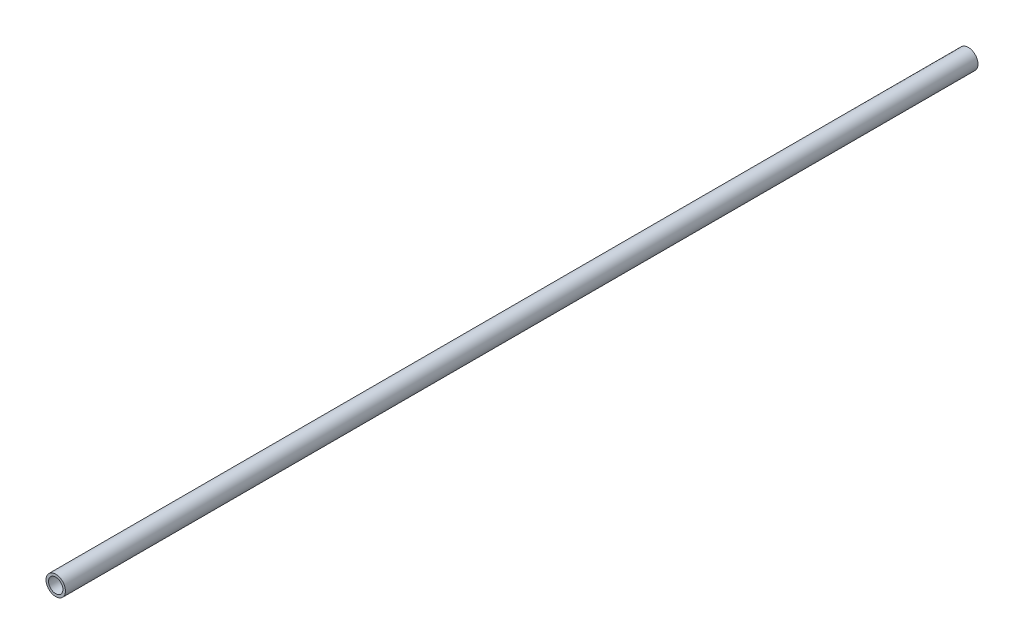
ISO-10303-21;
HEADER;
FILE_DESCRIPTION(('STEP AP214'),'2;1');
FILE_NAME('part.step','',(''),(''),'','','');
FILE_SCHEMA(('AUTOMOTIVE_DESIGN { 1 0 10303 214 1 1 1 1 }'));
ENDSEC;
DATA;
#1=APPLICATION_CONTEXT('core data for automotive mechanical design processes');
#2=APPLICATION_PROTOCOL_DEFINITION('international standard','automotive_design',2000,#1);
#3=PRODUCT_CONTEXT('',#1,'mechanical');
#4=PRODUCT('Part','Part','',(#3));
#5=PRODUCT_RELATED_PRODUCT_CATEGORY('part','',(#4));
#6=PRODUCT_DEFINITION_FORMATION('','',#4);
#7=PRODUCT_DEFINITION_CONTEXT('part definition',#1,'design');
#8=PRODUCT_DEFINITION('design','',#6,#7);
#9=PRODUCT_DEFINITION_SHAPE('','',#8);
#10=(LENGTH_UNIT() NAMED_UNIT(*) SI_UNIT(.MILLI.,.METRE.));
#11=(NAMED_UNIT(*) PLANE_ANGLE_UNIT() SI_UNIT($,.RADIAN.));
#12=(NAMED_UNIT(*) SI_UNIT($,.STERADIAN.) SOLID_ANGLE_UNIT());
#13=UNCERTAINTY_MEASURE_WITH_UNIT(LENGTH_MEASURE(1.E-05),#10,'distance_accuracy_value','');
#14=(GEOMETRIC_REPRESENTATION_CONTEXT(3) GLOBAL_UNCERTAINTY_ASSIGNED_CONTEXT((#13)) GLOBAL_UNIT_ASSIGNED_CONTEXT((#10,
#11,#12)) REPRESENTATION_CONTEXT('',''));
#15=CARTESIAN_POINT('',(0.,0.,0.));
#16=DIRECTION('',(0.,0.,1.));
#17=DIRECTION('',(1.,0.,0.));
#18=AXIS2_PLACEMENT_3D('',#15,#16,#17);
#19=CARTESIAN_POINT('',(0.,0.,500.));
#20=DIRECTION('',(0.,0.,1.));
#21=DIRECTION('',(1.,0.,0.));
#22=AXIS2_PLACEMENT_3D('',#19,#20,#21);
#23=PLANE('',#22);
#24=CARTESIAN_POINT('',(0.,0.,500.));
#25=DIRECTION('',(0.,0.,1.));
#26=DIRECTION('',(1.,0.,0.));
#27=AXIS2_PLACEMENT_3D('',#24,#25,#26);
#28=CIRCLE('',#27,10.668);
#29=CARTESIAN_POINT('',(10.668,0.,500.));
#30=VERTEX_POINT('',#29);
#31=EDGE_CURVE('E11',#30,#30,#28,.T.);
#32=ORIENTED_EDGE('',*,*,#31,.T.);
#33=EDGE_LOOP('',(#32));
#34=FACE_BOUND('',#33,.T.);
#35=CARTESIAN_POINT('',(0.,0.,500.));
#36=DIRECTION('',(0.,0.,1.));
#37=DIRECTION('',(1.,0.,0.));
#38=AXIS2_PLACEMENT_3D('',#35,#36,#37);
#39=CIRCLE('',#38,7.8994);
#40=CARTESIAN_POINT('',(7.8994,0.,500.));
#41=VERTEX_POINT('',#40);
#42=EDGE_CURVE('E48',#41,#41,#39,.T.);
#43=ORIENTED_EDGE('',*,*,#42,.F.);
#44=EDGE_LOOP('',(#43));
#45=FACE_BOUND('',#44,.T.);
#46=ADVANCED_FACE('F37',(#34,#45),#23,.T.);
#47=CARTESIAN_POINT('',(0.,0.,-500.));
#48=DIRECTION('',(0.,0.,1.));
#49=DIRECTION('',(1.,0.,0.));
#50=AXIS2_PLACEMENT_3D('',#47,#48,#49);
#51=PLANE('',#50);
#52=CARTESIAN_POINT('',(0.,0.,-500.));
#53=DIRECTION('',(0.,0.,1.));
#54=DIRECTION('',(1.,0.,0.));
#55=AXIS2_PLACEMENT_3D('',#52,#53,#54);
#56=CIRCLE('',#55,10.668);
#57=CARTESIAN_POINT('',(10.668,0.,-500.));
#58=VERTEX_POINT('',#57);
#59=EDGE_CURVE('E41',#58,#58,#56,.T.);
#60=ORIENTED_EDGE('',*,*,#59,.F.);
#61=EDGE_LOOP('',(#60));
#62=FACE_BOUND('',#61,.T.);
#63=CARTESIAN_POINT('',(0.,0.,-500.));
#64=DIRECTION('',(0.,0.,1.));
#65=DIRECTION('',(1.,0.,0.));
#66=AXIS2_PLACEMENT_3D('',#63,#64,#65);
#67=CIRCLE('',#66,7.8994);
#68=CARTESIAN_POINT('',(7.8994,0.,-500.));
#69=VERTEX_POINT('',#68);
#70=EDGE_CURVE('E50',#69,#69,#67,.T.);
#71=ORIENTED_EDGE('',*,*,#70,.T.);
#72=EDGE_LOOP('',(#71));
#73=FACE_BOUND('',#72,.T.);
#74=ADVANCED_FACE('F60',(#62,#73),#51,.F.);
#75=CARTESIAN_POINT('',(0.,0.,500.));
#76=DIRECTION('',(0.,0.,-1.));
#77=DIRECTION('',(-1.,0.,0.));
#78=AXIS2_PLACEMENT_3D('',#75,#76,#77);
#79=CYLINDRICAL_SURFACE('',#78,10.668);
#80=ORIENTED_EDGE('',*,*,#31,.F.);
#81=EDGE_LOOP('',(#80));
#82=FACE_BOUND('',#81,.T.);
#83=ORIENTED_EDGE('',*,*,#59,.T.);
#84=EDGE_LOOP('',(#83));
#85=FACE_BOUND('',#84,.T.);
#86=ADVANCED_FACE('F39',(#82,#85),#79,.T.);
#87=CARTESIAN_POINT('',(0.,0.,500.));
#88=DIRECTION('',(0.,0.,-1.));
#89=DIRECTION('',(-1.,0.,0.));
#90=AXIS2_PLACEMENT_3D('',#87,#88,#89);
#91=CYLINDRICAL_SURFACE('',#90,7.8994);
#92=ORIENTED_EDGE('',*,*,#42,.T.);
#93=EDGE_LOOP('',(#92));
#94=FACE_BOUND('',#93,.T.);
#95=ORIENTED_EDGE('',*,*,#70,.F.);
#96=EDGE_LOOP('',(#95));
#97=FACE_BOUND('',#96,.T.);
#98=ADVANCED_FACE('F56',(#94,#97),#91,.F.);
#99=CLOSED_SHELL('',(#46,#74,#86,#98));
#100=MANIFOLD_SOLID_BREP('B2',#99);
#101=ADVANCED_BREP_SHAPE_REPRESENTATION('',(#18,#100),#14);
#102=SHAPE_DEFINITION_REPRESENTATION(#9,#101);
ENDSEC;
END-ISO-10303-21;
